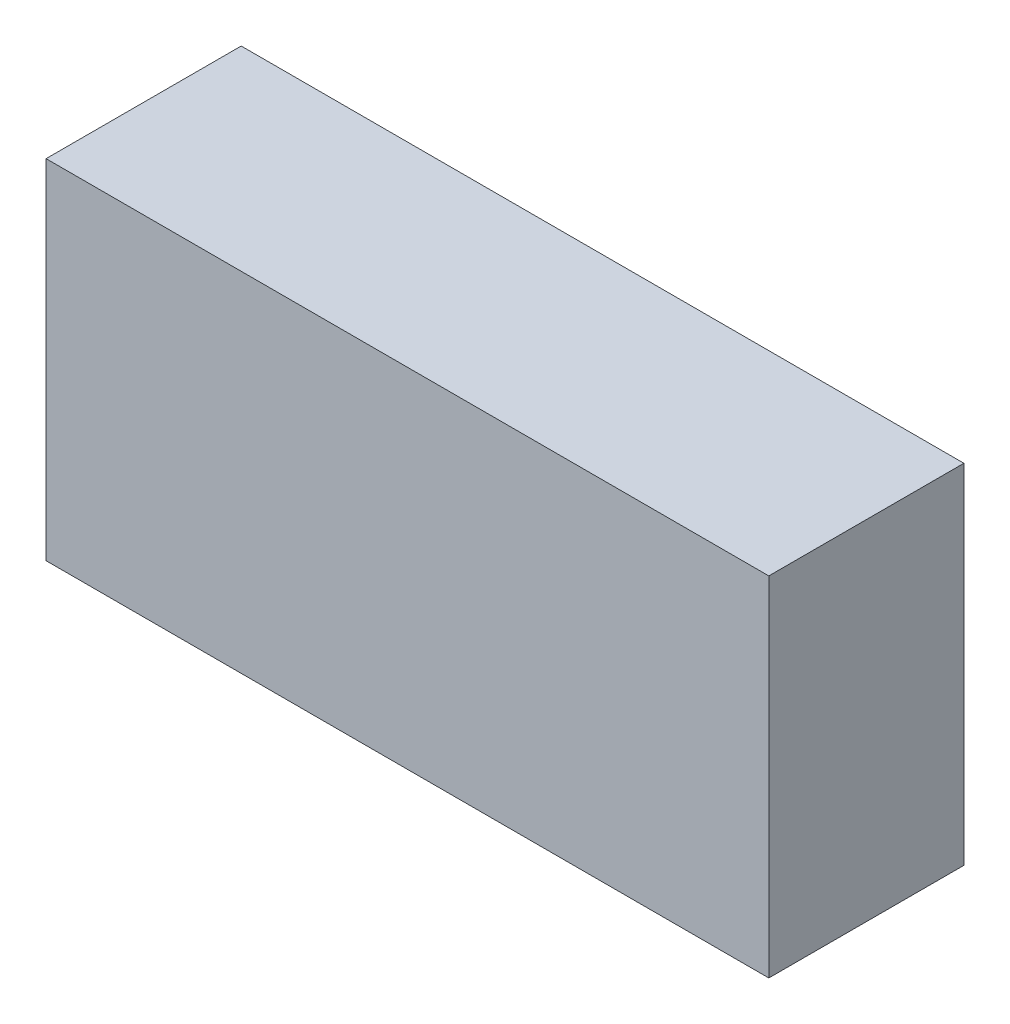
ISO-10303-21;
HEADER;
FILE_DESCRIPTION(('STEP AP214'),'2;1');
FILE_NAME('part.step','',(''),(''),'','','');
FILE_SCHEMA(('AUTOMOTIVE_DESIGN { 1 0 10303 214 1 1 1 1 }'));
ENDSEC;
DATA;
#1=APPLICATION_CONTEXT('core data for automotive mechanical design processes');
#2=APPLICATION_PROTOCOL_DEFINITION('international standard','automotive_design',2000,#1);
#3=PRODUCT_CONTEXT('',#1,'mechanical');
#4=PRODUCT('Part','Part','',(#3));
#5=PRODUCT_RELATED_PRODUCT_CATEGORY('part','',(#4));
#6=PRODUCT_DEFINITION_FORMATION('','',#4);
#7=PRODUCT_DEFINITION_CONTEXT('part definition',#1,'design');
#8=PRODUCT_DEFINITION('design','',#6,#7);
#9=PRODUCT_DEFINITION_SHAPE('','',#8);
#10=(LENGTH_UNIT() NAMED_UNIT(*) SI_UNIT(.MILLI.,.METRE.));
#11=(NAMED_UNIT(*) PLANE_ANGLE_UNIT() SI_UNIT($,.RADIAN.));
#12=(NAMED_UNIT(*) SI_UNIT($,.STERADIAN.) SOLID_ANGLE_UNIT());
#13=UNCERTAINTY_MEASURE_WITH_UNIT(LENGTH_MEASURE(1.E-05),#10,'distance_accuracy_value','');
#14=(GEOMETRIC_REPRESENTATION_CONTEXT(3) GLOBAL_UNCERTAINTY_ASSIGNED_CONTEXT((#13)) GLOBAL_UNIT_ASSIGNED_CONTEXT((#10,
#11,#12)) REPRESENTATION_CONTEXT('',''));
#15=CARTESIAN_POINT('',(0.,0.,0.));
#16=DIRECTION('',(0.,0.,1.));
#17=DIRECTION('',(1.,0.,0.));
#18=AXIS2_PLACEMENT_3D('',#15,#16,#17);
#19=CARTESIAN_POINT('',(0.,0.,54.53));
#20=DIRECTION('',(1.,0.,0.));
#21=DIRECTION('',(0.,0.,-1.));
#22=AXIS2_PLACEMENT_3D('',#19,#20,#21);
#23=PLANE('',#22);
#24=DIRECTION('',(0.,-1.,0.));
#25=VECTOR('',#24,1.);
#26=CARTESIAN_POINT('',(0.,0.,0.));
#27=LINE('',#26,#25);
#28=CARTESIAN_POINT('',(0.,97.33,0.));
#29=VERTEX_POINT('',#28);
#30=CARTESIAN_POINT('',(0.,0.,0.));
#31=VERTEX_POINT('',#30);
#32=EDGE_CURVE('E113',#29,#31,#27,.T.);
#33=ORIENTED_EDGE('',*,*,#32,.T.);
#34=DIRECTION('',(0.,0.,-1.));
#35=VECTOR('',#34,1.);
#36=CARTESIAN_POINT('',(0.,0.,54.53));
#37=LINE('',#36,#35);
#38=CARTESIAN_POINT('',(0.,0.,54.53));
#39=VERTEX_POINT('',#38);
#40=EDGE_CURVE('E11',#39,#31,#37,.T.);
#41=ORIENTED_EDGE('',*,*,#40,.F.);
#42=DIRECTION('',(0.,-1.,0.));
#43=VECTOR('',#42,1.);
#44=CARTESIAN_POINT('',(0.,0.,54.53));
#45=LINE('',#44,#43);
#46=CARTESIAN_POINT('',(0.,97.33,54.53));
#47=VERTEX_POINT('',#46);
#48=EDGE_CURVE('E97',#47,#39,#45,.T.);
#49=ORIENTED_EDGE('',*,*,#48,.F.);
#50=DIRECTION('',(0.,0.,-1.));
#51=VECTOR('',#50,1.);
#52=CARTESIAN_POINT('',(0.,97.33,54.53));
#53=LINE('',#52,#51);
#54=EDGE_CURVE('E109',#47,#29,#53,.T.);
#55=ORIENTED_EDGE('',*,*,#54,.T.);
#56=EDGE_LOOP('',(#33,#41,#49,#55));
#57=FACE_BOUND('',#56,.T.);
#58=ADVANCED_FACE('F45',(#57),#23,.F.);
#59=CARTESIAN_POINT('',(0.,0.,54.53));
#60=DIRECTION('',(0.,1.,0.));
#61=DIRECTION('',(0.,0.,1.));
#62=AXIS2_PLACEMENT_3D('',#59,#60,#61);
#63=PLANE('',#62);
#64=DIRECTION('',(1.,0.,0.));
#65=VECTOR('',#64,1.);
#66=CARTESIAN_POINT('',(0.,0.,0.));
#67=LINE('',#66,#65);
#68=CARTESIAN_POINT('',(202.,0.,0.));
#69=VERTEX_POINT('',#68);
#70=EDGE_CURVE('E102',#31,#69,#67,.T.);
#71=ORIENTED_EDGE('',*,*,#70,.T.);
#72=DIRECTION('',(0.,0.,-1.));
#73=VECTOR('',#72,1.);
#74=CARTESIAN_POINT('',(202.,0.,54.53));
#75=LINE('',#74,#73);
#76=CARTESIAN_POINT('',(202.,0.,54.53));
#77=VERTEX_POINT('',#76);
#78=EDGE_CURVE('E54',#77,#69,#75,.T.);
#79=ORIENTED_EDGE('',*,*,#78,.F.);
#80=DIRECTION('',(1.,0.,0.));
#81=VECTOR('',#80,1.);
#82=CARTESIAN_POINT('',(0.,0.,54.53));
#83=LINE('',#82,#81);
#84=EDGE_CURVE('E92',#39,#77,#83,.T.);
#85=ORIENTED_EDGE('',*,*,#84,.F.);
#86=ORIENTED_EDGE('',*,*,#40,.T.);
#87=EDGE_LOOP('',(#71,#79,#85,#86));
#88=FACE_BOUND('',#87,.T.);
#89=ADVANCED_FACE('F101',(#88),#63,.F.);
#90=CARTESIAN_POINT('',(202.,0.,54.53));
#91=DIRECTION('',(-1.,0.,0.));
#92=DIRECTION('',(0.,0.,1.));
#93=AXIS2_PLACEMENT_3D('',#90,#91,#92);
#94=PLANE('',#93);
#95=DIRECTION('',(0.,1.,0.));
#96=VECTOR('',#95,1.);
#97=CARTESIAN_POINT('',(202.,0.,0.));
#98=LINE('',#97,#96);
#99=CARTESIAN_POINT('',(202.,97.33,0.));
#100=VERTEX_POINT('',#99);
#101=EDGE_CURVE('E79',#69,#100,#98,.T.);
#102=ORIENTED_EDGE('',*,*,#101,.T.);
#103=DIRECTION('',(0.,0.,-1.));
#104=VECTOR('',#103,1.);
#105=CARTESIAN_POINT('',(202.,97.33,54.53));
#106=LINE('',#105,#104);
#107=CARTESIAN_POINT('',(202.,97.33,54.53));
#108=VERTEX_POINT('',#107);
#109=EDGE_CURVE('E104',#108,#100,#106,.T.);
#110=ORIENTED_EDGE('',*,*,#109,.F.);
#111=DIRECTION('',(0.,1.,0.));
#112=VECTOR('',#111,1.);
#113=CARTESIAN_POINT('',(202.,0.,54.53));
#114=LINE('',#113,#112);
#115=EDGE_CURVE('E95',#77,#108,#114,.T.);
#116=ORIENTED_EDGE('',*,*,#115,.F.);
#117=ORIENTED_EDGE('',*,*,#78,.T.);
#118=EDGE_LOOP('',(#102,#110,#116,#117));
#119=FACE_BOUND('',#118,.T.);
#120=ADVANCED_FACE('F105',(#119),#94,.F.);
#121=CARTESIAN_POINT('',(0.,97.33,54.53));
#122=DIRECTION('',(0.,-1.,0.));
#123=DIRECTION('',(0.,0.,-1.));
#124=AXIS2_PLACEMENT_3D('',#121,#122,#123);
#125=PLANE('',#124);
#126=DIRECTION('',(-1.,0.,0.));
#127=VECTOR('',#126,1.);
#128=CARTESIAN_POINT('',(0.,97.33,0.));
#129=LINE('',#128,#127);
#130=EDGE_CURVE('E85',#100,#29,#129,.T.);
#131=ORIENTED_EDGE('',*,*,#130,.T.);
#132=ORIENTED_EDGE('',*,*,#54,.F.);
#133=DIRECTION('',(-1.,0.,0.));
#134=VECTOR('',#133,1.);
#135=CARTESIAN_POINT('',(0.,97.33,54.53));
#136=LINE('',#135,#134);
#137=EDGE_CURVE('E62',#108,#47,#136,.T.);
#138=ORIENTED_EDGE('',*,*,#137,.F.);
#139=ORIENTED_EDGE('',*,*,#109,.T.);
#140=EDGE_LOOP('',(#131,#132,#138,#139));
#141=FACE_BOUND('',#140,.T.);
#142=ADVANCED_FACE('F126',(#141),#125,.F.);
#143=CARTESIAN_POINT('',(0.,0.,54.53));
#144=DIRECTION('',(0.,0.,-1.));
#145=DIRECTION('',(-1.,0.,0.));
#146=AXIS2_PLACEMENT_3D('',#143,#144,#145);
#147=PLANE('',#146);
#148=ORIENTED_EDGE('',*,*,#48,.T.);
#149=ORIENTED_EDGE('',*,*,#84,.T.);
#150=ORIENTED_EDGE('',*,*,#115,.T.);
#151=ORIENTED_EDGE('',*,*,#137,.T.);
#152=EDGE_LOOP('',(#148,#149,#150,#151));
#153=FACE_BOUND('',#152,.T.);
#154=ADVANCED_FACE('F93',(#153),#147,.F.);
#155=CARTESIAN_POINT('',(0.,0.,0.));
#156=DIRECTION('',(0.,0.,-1.));
#157=DIRECTION('',(-1.,0.,0.));
#158=AXIS2_PLACEMENT_3D('',#155,#156,#157);
#159=PLANE('',#158);
#160=ORIENTED_EDGE('',*,*,#32,.F.);
#161=ORIENTED_EDGE('',*,*,#130,.F.);
#162=ORIENTED_EDGE('',*,*,#101,.F.);
#163=ORIENTED_EDGE('',*,*,#70,.F.);
#164=EDGE_LOOP('',(#160,#161,#162,#163));
#165=FACE_BOUND('',#164,.T.);
#166=ADVANCED_FACE('F129',(#165),#159,.T.);
#167=CLOSED_SHELL('',(#58,#89,#120,#142,#154,#166));
#168=MANIFOLD_SOLID_BREP('B2',#167);
#169=ADVANCED_BREP_SHAPE_REPRESENTATION('',(#18,#168),#14);
#170=SHAPE_DEFINITION_REPRESENTATION(#9,#169);
ENDSEC;
END-ISO-10303-21;
